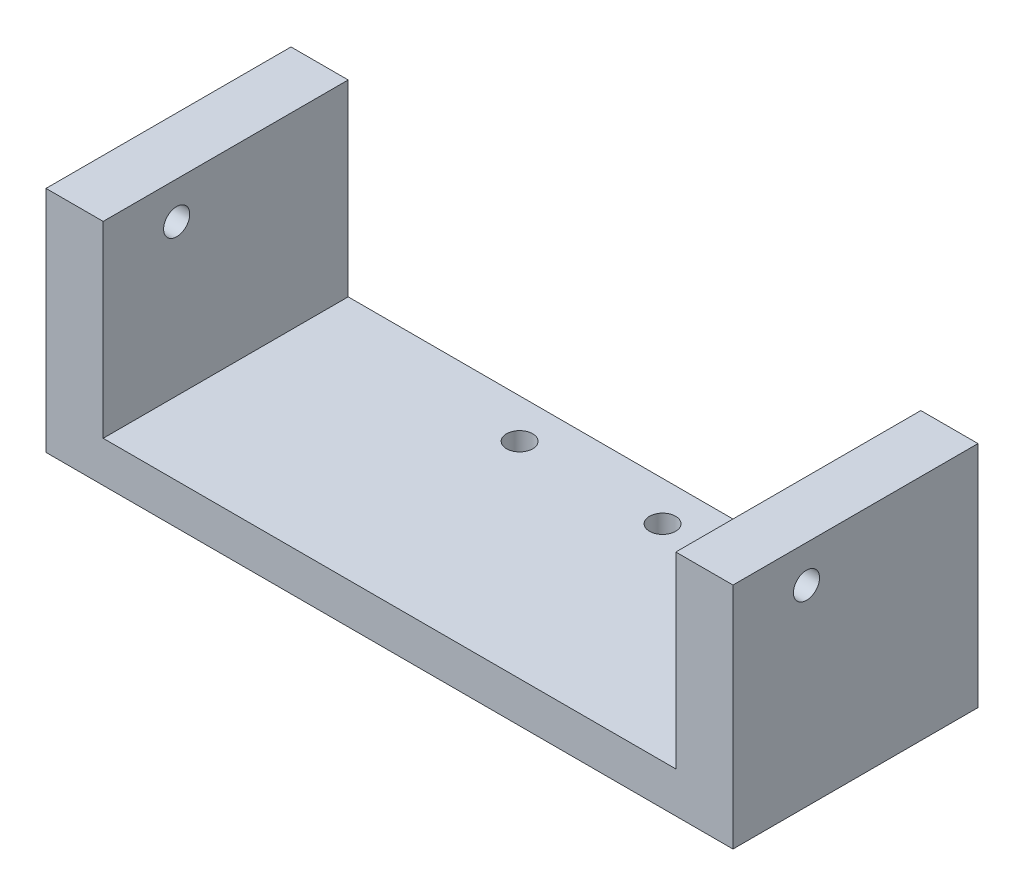
ISO-10303-21;
HEADER;
FILE_DESCRIPTION(('STEP AP214'),'2;1');
FILE_NAME('part.step','',(''),(''),'','','');
FILE_SCHEMA(('AUTOMOTIVE_DESIGN { 1 0 10303 214 1 1 1 1 }'));
ENDSEC;
DATA;
#1=APPLICATION_CONTEXT('core data for automotive mechanical design processes');
#2=APPLICATION_PROTOCOL_DEFINITION('international standard','automotive_design',2000,#1);
#3=PRODUCT_CONTEXT('',#1,'mechanical');
#4=PRODUCT('Part','Part','',(#3));
#5=PRODUCT_RELATED_PRODUCT_CATEGORY('part','',(#4));
#6=PRODUCT_DEFINITION_FORMATION('','',#4);
#7=PRODUCT_DEFINITION_CONTEXT('part definition',#1,'design');
#8=PRODUCT_DEFINITION('design','',#6,#7);
#9=PRODUCT_DEFINITION_SHAPE('','',#8);
#10=(LENGTH_UNIT() NAMED_UNIT(*) SI_UNIT(.MILLI.,.METRE.));
#11=(NAMED_UNIT(*) PLANE_ANGLE_UNIT() SI_UNIT($,.RADIAN.));
#12=(NAMED_UNIT(*) SI_UNIT($,.STERADIAN.) SOLID_ANGLE_UNIT());
#13=UNCERTAINTY_MEASURE_WITH_UNIT(LENGTH_MEASURE(1.E-05),#10,'distance_accuracy_value','');
#14=(GEOMETRIC_REPRESENTATION_CONTEXT(3) GLOBAL_UNCERTAINTY_ASSIGNED_CONTEXT((#13)) GLOBAL_UNIT_ASSIGNED_CONTEXT((#10,
#11,#12)) REPRESENTATION_CONTEXT('',''));
#15=CARTESIAN_POINT('',(0.,0.,0.));
#16=DIRECTION('',(0.,0.,1.));
#17=DIRECTION('',(1.,0.,0.));
#18=AXIS2_PLACEMENT_3D('',#15,#16,#17);
#19=CARTESIAN_POINT('',(0.,8.,0.));
#20=DIRECTION('',(0.,1.,0.));
#21=DIRECTION('',(0.,0.,1.));
#22=AXIS2_PLACEMENT_3D('',#19,#20,#21);
#23=PLANE('',#22);
#24=CARTESIAN_POINT('',(-8.75,8.,-45.1813672044761));
#25=DIRECTION('',(0.,1.,0.));
#26=DIRECTION('',(0.,0.,1.));
#27=AXIS2_PLACEMENT_3D('',#24,#25,#26);
#28=CIRCLE('',#27,1.6);
#29=CARTESIAN_POINT('',(-8.75,8.,-43.5813672044761));
#30=VERTEX_POINT('',#29);
#31=EDGE_CURVE('E144',#30,#30,#28,.F.);
#32=ORIENTED_EDGE('',*,*,#31,.T.);
#33=EDGE_LOOP('',(#32));
#34=FACE_BOUND('',#33,.T.);
#35=CARTESIAN_POINT('',(8.75,8.,-45.1813672044761));
#36=DIRECTION('',(0.,1.,0.));
#37=DIRECTION('',(0.,0.,1.));
#38=AXIS2_PLACEMENT_3D('',#35,#36,#37);
#39=CIRCLE('',#38,1.6);
#40=CARTESIAN_POINT('',(8.75,8.,-43.5813672044761));
#41=VERTEX_POINT('',#40);
#42=EDGE_CURVE('E126',#41,#41,#39,.F.);
#43=ORIENTED_EDGE('',*,*,#42,.T.);
#44=EDGE_LOOP('',(#43));
#45=FACE_BOUND('',#44,.T.);
#46=DIRECTION('',(1.,0.,0.));
#47=VECTOR('',#46,1.);
#48=CARTESIAN_POINT('',(0.,8.,-20.));
#49=LINE('',#48,#47);
#50=CARTESIAN_POINT('',(-34.5595986750516,8.,-20.));
#51=VERTEX_POINT('',#50);
#52=CARTESIAN_POINT('',(35.5550381642744,8.,-20.));
#53=VERTEX_POINT('',#52);
#54=EDGE_CURVE('E58',#51,#53,#49,.T.);
#55=ORIENTED_EDGE('',*,*,#54,.T.);
#56=DIRECTION('',(0.,0.,1.));
#57=VECTOR('',#56,1.);
#58=CARTESIAN_POINT('',(35.5550381642744,8.,-50.));
#59=LINE('',#58,#57);
#60=CARTESIAN_POINT('',(35.5550381642744,8.,-50.));
#61=VERTEX_POINT('',#60);
#62=EDGE_CURVE('E53',#61,#53,#59,.T.);
#63=ORIENTED_EDGE('',*,*,#62,.F.);
#64=DIRECTION('',(-1.,0.,0.));
#65=VECTOR('',#64,1.);
#66=CARTESIAN_POINT('',(0.,8.,-50.));
#67=LINE('',#66,#65);
#68=CARTESIAN_POINT('',(-34.5595986750516,8.,-50.));
#69=VERTEX_POINT('',#68);
#70=EDGE_CURVE('E110',#61,#69,#67,.T.);
#71=ORIENTED_EDGE('',*,*,#70,.T.);
#72=DIRECTION('',(0.,0.,-1.));
#73=VECTOR('',#72,1.);
#74=CARTESIAN_POINT('',(-34.5595986750516,8.,-50.));
#75=LINE('',#74,#73);
#76=EDGE_CURVE('E162',#51,#69,#75,.T.);
#77=ORIENTED_EDGE('',*,*,#76,.F.);
#78=EDGE_LOOP('',(#55,#63,#71,#77));
#79=FACE_BOUND('',#78,.T.);
#80=ADVANCED_FACE('F36',(#34,#45,#79),#23,.T.);
#81=CARTESIAN_POINT('',(-47.85,3.,-50.));
#82=DIRECTION('',(0.,0.,1.));
#83=DIRECTION('',(1.,0.,0.));
#84=AXIS2_PLACEMENT_3D('',#81,#82,#83);
#85=PLANE('',#84);
#86=DIRECTION('',(0.,-1.,0.));
#87=VECTOR('',#86,1.);
#88=CARTESIAN_POINT('',(42.5550381642744,8.,-50.));
#89=LINE('',#88,#87);
#90=CARTESIAN_POINT('',(42.5550381642744,31.,-50.));
#91=VERTEX_POINT('',#90);
#92=CARTESIAN_POINT('',(42.5550381642744,3.,-50.));
#93=VERTEX_POINT('',#92);
#94=EDGE_CURVE('E11',#91,#93,#89,.T.);
#95=ORIENTED_EDGE('',*,*,#94,.T.);
#96=DIRECTION('',(-1.,0.,0.));
#97=VECTOR('',#96,1.);
#98=CARTESIAN_POINT('',(-47.85,3.,-50.));
#99=LINE('',#98,#97);
#100=CARTESIAN_POINT('',(-41.5595986750516,3.,-50.));
#101=VERTEX_POINT('',#100);
#102=EDGE_CURVE('E188',#93,#101,#99,.T.);
#103=ORIENTED_EDGE('',*,*,#102,.T.);
#104=DIRECTION('',(0.,-1.,0.));
#105=VECTOR('',#104,1.);
#106=CARTESIAN_POINT('',(-41.5595986750516,8.,-50.));
#107=LINE('',#106,#105);
#108=CARTESIAN_POINT('',(-41.5595986750516,31.,-50.));
#109=VERTEX_POINT('',#108);
#110=EDGE_CURVE('E45',#109,#101,#107,.T.);
#111=ORIENTED_EDGE('',*,*,#110,.F.);
#112=DIRECTION('',(-1.,0.,0.));
#113=VECTOR('',#112,1.);
#114=CARTESIAN_POINT('',(-41.5595986750516,31.,-50.));
#115=LINE('',#114,#113);
#116=CARTESIAN_POINT('',(-34.5595986750516,31.,-50.));
#117=VERTEX_POINT('',#116);
#118=EDGE_CURVE('E161',#117,#109,#115,.T.);
#119=ORIENTED_EDGE('',*,*,#118,.F.);
#120=DIRECTION('',(0.,-1.,0.));
#121=VECTOR('',#120,1.);
#122=CARTESIAN_POINT('',(-34.5595986750516,31.,-50.));
#123=LINE('',#122,#121);
#124=EDGE_CURVE('E157',#117,#69,#123,.T.);
#125=ORIENTED_EDGE('',*,*,#124,.T.);
#126=ORIENTED_EDGE('',*,*,#70,.F.);
#127=DIRECTION('',(0.,-1.,0.));
#128=VECTOR('',#127,1.);
#129=CARTESIAN_POINT('',(35.5550381642744,31.,-50.));
#130=LINE('',#129,#128);
#131=CARTESIAN_POINT('',(35.5550381642744,31.,-50.));
#132=VERTEX_POINT('',#131);
#133=EDGE_CURVE('E165',#132,#61,#130,.T.);
#134=ORIENTED_EDGE('',*,*,#133,.F.);
#135=DIRECTION('',(-1.,0.,0.));
#136=VECTOR('',#135,1.);
#137=CARTESIAN_POINT('',(42.5550381642744,31.,-50.));
#138=LINE('',#137,#136);
#139=EDGE_CURVE('E212',#91,#132,#138,.T.);
#140=ORIENTED_EDGE('',*,*,#139,.F.);
#141=EDGE_LOOP('',(#95,#103,#111,#119,#125,#126,#134,#140));
#142=FACE_BOUND('',#141,.T.);
#143=ADVANCED_FACE('F38',(#142),#85,.F.);
#144=CARTESIAN_POINT('',(-8.75,3.,-45.1813672044761));
#145=DIRECTION('',(0.,-1.,0.));
#146=DIRECTION('',(0.,0.,-1.));
#147=AXIS2_PLACEMENT_3D('',#144,#145,#146);
#148=CYLINDRICAL_SURFACE('',#147,1.6);
#149=CARTESIAN_POINT('',(-8.75,3.,-45.1813672044761));
#150=DIRECTION('',(0.,1.,0.));
#151=DIRECTION('',(0.,0.,1.));
#152=AXIS2_PLACEMENT_3D('',#149,#150,#151);
#153=CIRCLE('',#152,1.6);
#154=CARTESIAN_POINT('',(-8.75,3.,-43.5813672044761));
#155=VERTEX_POINT('',#154);
#156=EDGE_CURVE('E193',#155,#155,#153,.T.);
#157=ORIENTED_EDGE('',*,*,#156,.F.);
#158=EDGE_LOOP('',(#157));
#159=FACE_BOUND('',#158,.T.);
#160=ORIENTED_EDGE('',*,*,#31,.F.);
#161=EDGE_LOOP('',(#160));
#162=FACE_BOUND('',#161,.T.);
#163=ADVANCED_FACE('F231',(#159,#162),#148,.F.);
#164=CARTESIAN_POINT('',(8.75,3.,-45.1813672044761));
#165=DIRECTION('',(0.,-1.,0.));
#166=DIRECTION('',(0.,0.,-1.));
#167=AXIS2_PLACEMENT_3D('',#164,#165,#166);
#168=CYLINDRICAL_SURFACE('',#167,1.6);
#169=CARTESIAN_POINT('',(8.75,3.,-45.1813672044761));
#170=DIRECTION('',(0.,1.,0.));
#171=DIRECTION('',(0.,0.,1.));
#172=AXIS2_PLACEMENT_3D('',#169,#170,#171);
#173=CIRCLE('',#172,1.6);
#174=CARTESIAN_POINT('',(8.75,3.,-43.5813672044761));
#175=VERTEX_POINT('',#174);
#176=EDGE_CURVE('E190',#175,#175,#173,.T.);
#177=ORIENTED_EDGE('',*,*,#176,.F.);
#178=EDGE_LOOP('',(#177));
#179=FACE_BOUND('',#178,.T.);
#180=ORIENTED_EDGE('',*,*,#42,.F.);
#181=EDGE_LOOP('',(#180));
#182=FACE_BOUND('',#181,.T.);
#183=ADVANCED_FACE('F244',(#179,#182),#168,.F.);
#184=CARTESIAN_POINT('',(42.5550381642744,8.,0.));
#185=DIRECTION('',(1.,0.,0.));
#186=DIRECTION('',(0.,0.,-1.));
#187=AXIS2_PLACEMENT_3D('',#184,#185,#186);
#188=PLANE('',#187);
#189=CARTESIAN_POINT('',(42.5550381642744,26.474830263861,-29.));
#190=DIRECTION('',(1.,0.,0.));
#191=DIRECTION('',(0.,0.,-1.));
#192=AXIS2_PLACEMENT_3D('',#189,#190,#191);
#193=CIRCLE('',#192,1.6);
#194=CARTESIAN_POINT('',(42.5550381642744,26.474830263861,-30.6));
#195=VERTEX_POINT('',#194);
#196=EDGE_CURVE('E206',#195,#195,#193,.T.);
#197=ORIENTED_EDGE('',*,*,#196,.F.);
#198=EDGE_LOOP('',(#197));
#199=FACE_BOUND('',#198,.T.);
#200=DIRECTION('',(0.,0.,1.));
#201=VECTOR('',#200,1.);
#202=CARTESIAN_POINT('',(42.5550381642744,3.,0.));
#203=LINE('',#202,#201);
#204=CARTESIAN_POINT('',(42.5550381642744,3.,-20.));
#205=VERTEX_POINT('',#204);
#206=EDGE_CURVE('E106',#93,#205,#203,.T.);
#207=ORIENTED_EDGE('',*,*,#206,.F.);
#208=ORIENTED_EDGE('',*,*,#94,.F.);
#209=DIRECTION('',(0.,0.,-1.));
#210=VECTOR('',#209,1.);
#211=CARTESIAN_POINT('',(42.5550381642744,31.,-50.));
#212=LINE('',#211,#210);
#213=CARTESIAN_POINT('',(42.5550381642744,31.,-20.));
#214=VERTEX_POINT('',#213);
#215=EDGE_CURVE('E209',#214,#91,#212,.T.);
#216=ORIENTED_EDGE('',*,*,#215,.F.);
#217=DIRECTION('',(0.,-1.,0.));
#218=VECTOR('',#217,1.);
#219=CARTESIAN_POINT('',(42.5550381642744,8.,-20.));
#220=LINE('',#219,#218);
#221=EDGE_CURVE('E123',#214,#205,#220,.T.);
#222=ORIENTED_EDGE('',*,*,#221,.T.);
#223=EDGE_LOOP('',(#207,#208,#216,#222));
#224=FACE_BOUND('',#223,.T.);
#225=ADVANCED_FACE('F224',(#199,#224),#188,.T.);
#226=CARTESIAN_POINT('',(-41.5595986750516,8.,0.));
#227=DIRECTION('',(1.,0.,0.));
#228=DIRECTION('',(0.,0.,-1.));
#229=AXIS2_PLACEMENT_3D('',#226,#227,#228);
#230=PLANE('',#229);
#231=CARTESIAN_POINT('',(-41.5595986750516,26.474830263861,-29.));
#232=DIRECTION('',(-1.,0.,0.));
#233=DIRECTION('',(0.,0.,1.));
#234=AXIS2_PLACEMENT_3D('',#231,#232,#233);
#235=CIRCLE('',#234,1.6);
#236=CARTESIAN_POINT('',(-41.5595986750516,26.474830263861,-27.4));
#237=VERTEX_POINT('',#236);
#238=EDGE_CURVE('E200',#237,#237,#235,.T.);
#239=ORIENTED_EDGE('',*,*,#238,.F.);
#240=EDGE_LOOP('',(#239));
#241=FACE_BOUND('',#240,.T.);
#242=DIRECTION('',(0.,0.,1.));
#243=VECTOR('',#242,1.);
#244=CARTESIAN_POINT('',(-41.5595986750516,3.,0.));
#245=LINE('',#244,#243);
#246=CARTESIAN_POINT('',(-41.5595986750516,3.,-20.));
#247=VERTEX_POINT('',#246);
#248=EDGE_CURVE('E103',#101,#247,#245,.T.);
#249=ORIENTED_EDGE('',*,*,#248,.T.);
#250=DIRECTION('',(0.,-1.,0.));
#251=VECTOR('',#250,1.);
#252=CARTESIAN_POINT('',(-41.5595986750516,8.,-20.));
#253=LINE('',#252,#251);
#254=CARTESIAN_POINT('',(-41.5595986750516,31.,-20.));
#255=VERTEX_POINT('',#254);
#256=EDGE_CURVE('E116',#255,#247,#253,.T.);
#257=ORIENTED_EDGE('',*,*,#256,.F.);
#258=DIRECTION('',(0.,0.,1.));
#259=VECTOR('',#258,1.);
#260=CARTESIAN_POINT('',(-41.5595986750516,31.,-50.));
#261=LINE('',#260,#259);
#262=EDGE_CURVE('E164',#109,#255,#261,.T.);
#263=ORIENTED_EDGE('',*,*,#262,.F.);
#264=ORIENTED_EDGE('',*,*,#110,.T.);
#265=EDGE_LOOP('',(#249,#257,#263,#264));
#266=FACE_BOUND('',#265,.T.);
#267=ADVANCED_FACE('F114',(#241,#266),#230,.F.);
#268=CARTESIAN_POINT('',(0.,8.,-20.));
#269=DIRECTION('',(0.,0.,-1.));
#270=DIRECTION('',(-1.,0.,0.));
#271=AXIS2_PLACEMENT_3D('',#268,#269,#270);
#272=PLANE('',#271);
#273=DIRECTION('',(1.,0.,0.));
#274=VECTOR('',#273,1.);
#275=CARTESIAN_POINT('',(0.,3.,-20.));
#276=LINE('',#275,#274);
#277=EDGE_CURVE('E100',#247,#205,#276,.T.);
#278=ORIENTED_EDGE('',*,*,#277,.T.);
#279=ORIENTED_EDGE('',*,*,#221,.F.);
#280=DIRECTION('',(1.,0.,0.));
#281=VECTOR('',#280,1.);
#282=CARTESIAN_POINT('',(42.5550381642744,31.,-20.));
#283=LINE('',#282,#281);
#284=CARTESIAN_POINT('',(35.5550381642744,31.,-20.));
#285=VERTEX_POINT('',#284);
#286=EDGE_CURVE('E176',#285,#214,#283,.T.);
#287=ORIENTED_EDGE('',*,*,#286,.F.);
#288=DIRECTION('',(0.,-1.,0.));
#289=VECTOR('',#288,1.);
#290=CARTESIAN_POINT('',(35.5550381642744,31.,-20.));
#291=LINE('',#290,#289);
#292=EDGE_CURVE('E170',#285,#53,#291,.T.);
#293=ORIENTED_EDGE('',*,*,#292,.T.);
#294=ORIENTED_EDGE('',*,*,#54,.F.);
#295=DIRECTION('',(0.,-1.,0.));
#296=VECTOR('',#295,1.);
#297=CARTESIAN_POINT('',(-34.5595986750516,31.,-20.));
#298=LINE('',#297,#296);
#299=CARTESIAN_POINT('',(-34.5595986750516,31.,-20.));
#300=VERTEX_POINT('',#299);
#301=EDGE_CURVE('E137',#300,#51,#298,.T.);
#302=ORIENTED_EDGE('',*,*,#301,.F.);
#303=DIRECTION('',(1.,0.,0.));
#304=VECTOR('',#303,1.);
#305=CARTESIAN_POINT('',(-41.5595986750516,31.,-20.));
#306=LINE('',#305,#304);
#307=EDGE_CURVE('E121',#255,#300,#306,.T.);
#308=ORIENTED_EDGE('',*,*,#307,.F.);
#309=ORIENTED_EDGE('',*,*,#256,.T.);
#310=EDGE_LOOP('',(#278,#279,#287,#293,#294,#302,#308,#309));
#311=FACE_BOUND('',#310,.T.);
#312=ADVANCED_FACE('F119',(#311),#272,.F.);
#313=CARTESIAN_POINT('',(-34.5595986750516,31.,-50.));
#314=DIRECTION('',(-1.,0.,0.));
#315=DIRECTION('',(0.,0.,1.));
#316=AXIS2_PLACEMENT_3D('',#313,#314,#315);
#317=PLANE('',#316);
#318=CARTESIAN_POINT('',(-34.5595986750516,26.474830263861,-29.));
#319=DIRECTION('',(-1.,0.,0.));
#320=DIRECTION('',(0.,0.,1.));
#321=AXIS2_PLACEMENT_3D('',#318,#319,#320);
#322=CIRCLE('',#321,1.6);
#323=CARTESIAN_POINT('',(-34.5595986750516,26.474830263861,-27.4));
#324=VERTEX_POINT('',#323);
#325=EDGE_CURVE('E203',#324,#324,#322,.T.);
#326=ORIENTED_EDGE('',*,*,#325,.T.);
#327=EDGE_LOOP('',(#326));
#328=FACE_BOUND('',#327,.T.);
#329=ORIENTED_EDGE('',*,*,#76,.T.);
#330=ORIENTED_EDGE('',*,*,#124,.F.);
#331=DIRECTION('',(0.,0.,-1.));
#332=VECTOR('',#331,1.);
#333=CARTESIAN_POINT('',(-34.5595986750516,31.,-50.));
#334=LINE('',#333,#332);
#335=EDGE_CURVE('E181',#300,#117,#334,.T.);
#336=ORIENTED_EDGE('',*,*,#335,.F.);
#337=ORIENTED_EDGE('',*,*,#301,.T.);
#338=EDGE_LOOP('',(#329,#330,#336,#337));
#339=FACE_BOUND('',#338,.T.);
#340=ADVANCED_FACE('F235',(#328,#339),#317,.F.);
#341=CARTESIAN_POINT('',(0.,31.,0.));
#342=DIRECTION('',(0.,1.,0.));
#343=DIRECTION('',(0.,0.,1.));
#344=AXIS2_PLACEMENT_3D('',#341,#342,#343);
#345=PLANE('',#344);
#346=ORIENTED_EDGE('',*,*,#262,.T.);
#347=ORIENTED_EDGE('',*,*,#307,.T.);
#348=ORIENTED_EDGE('',*,*,#335,.T.);
#349=ORIENTED_EDGE('',*,*,#118,.T.);
#350=EDGE_LOOP('',(#346,#347,#348,#349));
#351=FACE_BOUND('',#350,.T.);
#352=ADVANCED_FACE('F185',(#351),#345,.T.);
#353=CARTESIAN_POINT('',(35.5550381642744,31.,-50.));
#354=DIRECTION('',(1.,0.,0.));
#355=DIRECTION('',(0.,0.,-1.));
#356=AXIS2_PLACEMENT_3D('',#353,#354,#355);
#357=PLANE('',#356);
#358=CARTESIAN_POINT('',(35.5550381642744,26.474830263861,-29.));
#359=DIRECTION('',(1.,0.,0.));
#360=DIRECTION('',(0.,0.,-1.));
#361=AXIS2_PLACEMENT_3D('',#358,#359,#360);
#362=CIRCLE('',#361,1.6);
#363=CARTESIAN_POINT('',(35.5550381642744,26.474830263861,-30.6));
#364=VERTEX_POINT('',#363);
#365=EDGE_CURVE('E40',#364,#364,#362,.T.);
#366=ORIENTED_EDGE('',*,*,#365,.T.);
#367=EDGE_LOOP('',(#366));
#368=FACE_BOUND('',#367,.T.);
#369=ORIENTED_EDGE('',*,*,#62,.T.);
#370=ORIENTED_EDGE('',*,*,#292,.F.);
#371=DIRECTION('',(0.,0.,1.));
#372=VECTOR('',#371,1.);
#373=CARTESIAN_POINT('',(35.5550381642744,31.,-50.));
#374=LINE('',#373,#372);
#375=EDGE_CURVE('E214',#132,#285,#374,.T.);
#376=ORIENTED_EDGE('',*,*,#375,.F.);
#377=ORIENTED_EDGE('',*,*,#133,.T.);
#378=EDGE_LOOP('',(#369,#370,#376,#377));
#379=FACE_BOUND('',#378,.T.);
#380=ADVANCED_FACE('F218',(#368,#379),#357,.F.);
#381=CARTESIAN_POINT('',(0.,31.,0.));
#382=DIRECTION('',(0.,-1.,0.));
#383=DIRECTION('',(0.,0.,-1.));
#384=AXIS2_PLACEMENT_3D('',#381,#382,#383);
#385=PLANE('',#384);
#386=ORIENTED_EDGE('',*,*,#215,.T.);
#387=ORIENTED_EDGE('',*,*,#139,.T.);
#388=ORIENTED_EDGE('',*,*,#375,.T.);
#389=ORIENTED_EDGE('',*,*,#286,.T.);
#390=EDGE_LOOP('',(#386,#387,#388,#389));
#391=FACE_BOUND('',#390,.T.);
#392=ADVANCED_FACE('F222',(#391),#385,.F.);
#393=CARTESIAN_POINT('',(72.4404013249484,26.474830263861,-29.));
#394=DIRECTION('',(-1.,0.,0.));
#395=DIRECTION('',(0.,0.,1.));
#396=AXIS2_PLACEMENT_3D('',#393,#394,#395);
#397=CYLINDRICAL_SURFACE('',#396,1.6);
#398=ORIENTED_EDGE('',*,*,#196,.T.);
#399=EDGE_LOOP('',(#398));
#400=FACE_BOUND('',#399,.T.);
#401=ORIENTED_EDGE('',*,*,#365,.F.);
#402=EDGE_LOOP('',(#401));
#403=FACE_BOUND('',#402,.T.);
#404=ADVANCED_FACE('F266',(#400,#403),#397,.F.);
#405=ORIENTED_EDGE('',*,*,#238,.T.);
#406=EDGE_LOOP('',(#405));
#407=FACE_BOUND('',#406,.T.);
#408=ORIENTED_EDGE('',*,*,#325,.F.);
#409=EDGE_LOOP('',(#408));
#410=FACE_BOUND('',#409,.T.);
#411=ADVANCED_FACE('F258',(#407,#410),#397,.F.);
#412=CARTESIAN_POINT('',(47.85,3.,-64.));
#413=DIRECTION('',(0.,1.,0.));
#414=DIRECTION('',(0.,0.,1.));
#415=AXIS2_PLACEMENT_3D('',#412,#413,#414);
#416=PLANE('',#415);
#417=ORIENTED_EDGE('',*,*,#156,.T.);
#418=EDGE_LOOP('',(#417));
#419=FACE_BOUND('',#418,.T.);
#420=ORIENTED_EDGE('',*,*,#176,.T.);
#421=EDGE_LOOP('',(#420));
#422=FACE_BOUND('',#421,.T.);
#423=ORIENTED_EDGE('',*,*,#206,.T.);
#424=ORIENTED_EDGE('',*,*,#277,.F.);
#425=ORIENTED_EDGE('',*,*,#248,.F.);
#426=ORIENTED_EDGE('',*,*,#102,.F.);
#427=EDGE_LOOP('',(#423,#424,#425,#426));
#428=FACE_BOUND('',#427,.T.);
#429=ADVANCED_FACE('F102',(#419,#422,#428),#416,.F.);
#430=CLOSED_SHELL('',(#80,#143,#163,#183,#225,#267,#312,#340,#352,#380,#392,#404,#411,#429));
#431=MANIFOLD_SOLID_BREP('B2',#430);
#432=ADVANCED_BREP_SHAPE_REPRESENTATION('',(#18,#431),#14);
#433=SHAPE_DEFINITION_REPRESENTATION(#9,#432);
ENDSEC;
END-ISO-10303-21;
